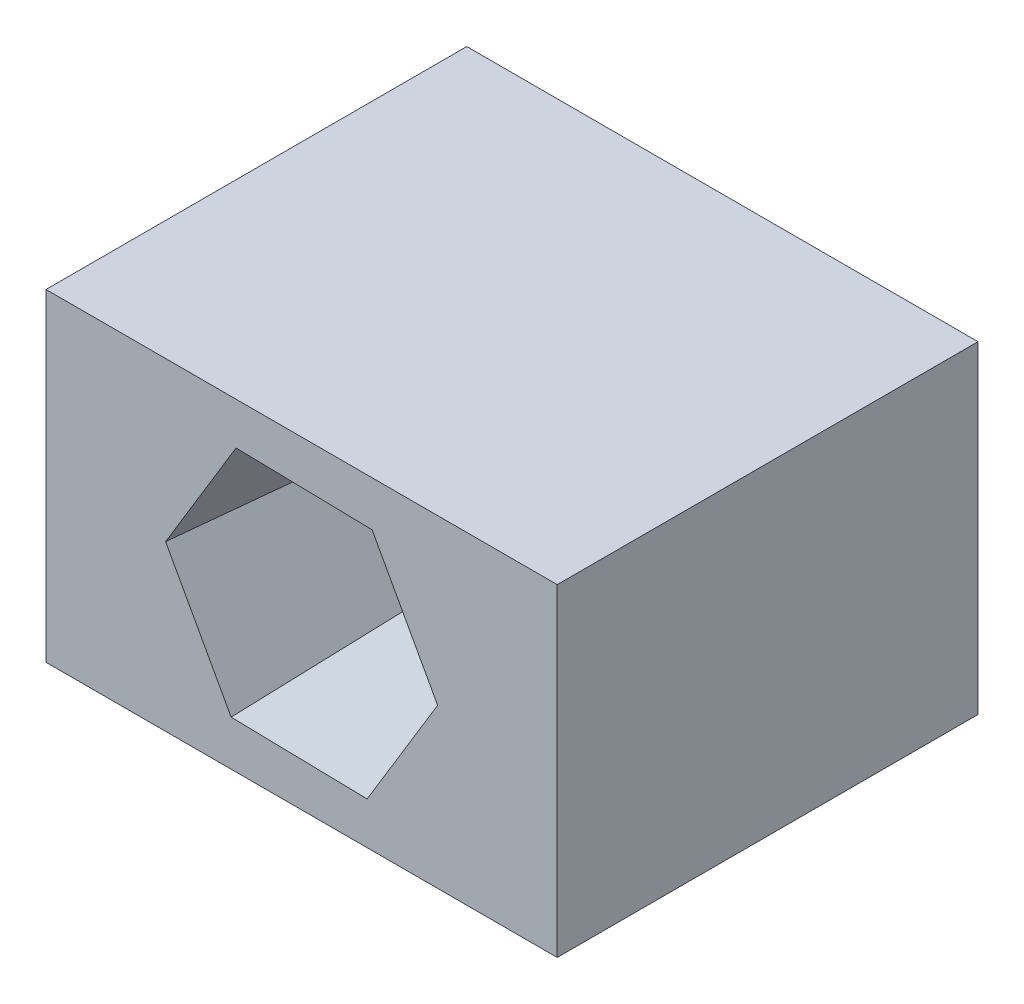
ISO-10303-21;
HEADER;
FILE_DESCRIPTION(('STEP AP214'),'2;1');
FILE_NAME('part.step','',(''),(''),'','','');
FILE_SCHEMA(('AUTOMOTIVE_DESIGN { 1 0 10303 214 1 1 1 1 }'));
ENDSEC;
DATA;
#1=APPLICATION_CONTEXT('core data for automotive mechanical design processes');
#2=APPLICATION_PROTOCOL_DEFINITION('international standard','automotive_design',2000,#1);
#3=PRODUCT_CONTEXT('',#1,'mechanical');
#4=PRODUCT('Part','Part','',(#3));
#5=PRODUCT_RELATED_PRODUCT_CATEGORY('part','',(#4));
#6=PRODUCT_DEFINITION_FORMATION('','',#4);
#7=PRODUCT_DEFINITION_CONTEXT('part definition',#1,'design');
#8=PRODUCT_DEFINITION('design','',#6,#7);
#9=PRODUCT_DEFINITION_SHAPE('','',#8);
#10=(LENGTH_UNIT() NAMED_UNIT(*) SI_UNIT(.MILLI.,.METRE.));
#11=(NAMED_UNIT(*) PLANE_ANGLE_UNIT() SI_UNIT($,.RADIAN.));
#12=(NAMED_UNIT(*) SI_UNIT($,.STERADIAN.) SOLID_ANGLE_UNIT());
#13=UNCERTAINTY_MEASURE_WITH_UNIT(LENGTH_MEASURE(1.E-05),#10,'distance_accuracy_value','');
#14=(GEOMETRIC_REPRESENTATION_CONTEXT(3) GLOBAL_UNCERTAINTY_ASSIGNED_CONTEXT((#13)) GLOBAL_UNIT_ASSIGNED_CONTEXT((#10,
#11,#12)) REPRESENTATION_CONTEXT('',''));
#15=CARTESIAN_POINT('',(0.,0.,0.));
#16=DIRECTION('',(0.,0.,1.));
#17=DIRECTION('',(1.,0.,0.));
#18=AXIS2_PLACEMENT_3D('',#15,#16,#17);
#19=CARTESIAN_POINT('',(0.,0.,10.));
#20=DIRECTION('',(0.,0.,-1.));
#21=DIRECTION('',(-1.,0.,0.));
#22=AXIS2_PLACEMENT_3D('',#19,#20,#21);
#23=CYLINDRICAL_SURFACE('',#22,1.7);
#24=CARTESIAN_POINT('',(0.,0.,0.));
#25=DIRECTION('',(0.,0.,1.));
#26=DIRECTION('',(1.,0.,0.));
#27=AXIS2_PLACEMENT_3D('',#24,#25,#26);
#28=CIRCLE('',#27,1.7);
#29=CARTESIAN_POINT('',(1.7,0.,0.));
#30=VERTEX_POINT('',#29);
#31=EDGE_CURVE('E176',#30,#30,#28,.T.);
#32=ORIENTED_EDGE('',*,*,#31,.F.);
#33=EDGE_LOOP('',(#32));
#34=FACE_BOUND('',#33,.T.);
#35=CARTESIAN_POINT('',(0.,0.,5.));
#36=DIRECTION('',(0.,0.,1.));
#37=DIRECTION('',(1.,0.,0.));
#38=AXIS2_PLACEMENT_3D('',#35,#36,#37);
#39=CIRCLE('',#38,1.7);
#40=CARTESIAN_POINT('',(1.7,0.,5.));
#41=VERTEX_POINT('',#40);
#42=EDGE_CURVE('E37',#41,#41,#39,.T.);
#43=ORIENTED_EDGE('',*,*,#42,.T.);
#44=EDGE_LOOP('',(#43));
#45=FACE_BOUND('',#44,.T.);
#46=ADVANCED_FACE('F33',(#34,#45),#23,.F.);
#47=CARTESIAN_POINT('',(0.,0.,10.));
#48=DIRECTION('',(0.,0.,-1.));
#49=DIRECTION('',(-1.,0.,0.));
#50=AXIS2_PLACEMENT_3D('',#47,#48,#49);
#51=PLANE('',#50);
#52=DIRECTION('',(-0.999775709837172,0.0211785273232077,0.));
#53=VECTOR('',#52,1.);
#54=CARTESIAN_POINT('',(1.67551804707545,2.76513518788102,10.));
#55=LINE('',#54,#53);
#56=CARTESIAN_POINT('',(1.67551804707545,2.76513518788102,10.));
#57=VERTEX_POINT('',#56);
#58=CARTESIAN_POINT('',(-1.55691829406549,2.83360878720715,10.));
#59=VERTEX_POINT('',#58);
#60=EDGE_CURVE('E135',#57,#59,#55,.T.);
#61=ORIENTED_EDGE('',*,*,#60,.F.);
#62=DIRECTION('',(-0.481546712241945,0.876420426467214,0.));
#63=VECTOR('',#62,1.);
#64=CARTESIAN_POINT('',(3.23243634114095,-0.068473599326124,10.));
#65=LINE('',#64,#63);
#66=CARTESIAN_POINT('',(3.23243634114095,-0.068473599326124,10.));
#67=VERTEX_POINT('',#66);
#68=EDGE_CURVE('E49',#67,#57,#65,.T.);
#69=ORIENTED_EDGE('',*,*,#68,.F.);
#70=DIRECTION('',(0.518228997595226,0.855241899144007,0.));
#71=VECTOR('',#70,1.);
#72=CARTESIAN_POINT('',(1.55691829406549,-2.83360878720714,10.));
#73=LINE('',#72,#71);
#74=CARTESIAN_POINT('',(1.55691829406549,-2.83360878720714,10.));
#75=VERTEX_POINT('',#74);
#76=EDGE_CURVE('E150',#75,#67,#73,.T.);
#77=ORIENTED_EDGE('',*,*,#76,.F.);
#78=DIRECTION('',(0.999775709837171,-0.0211785273232075,0.));
#79=VECTOR('',#78,1.);
#80=CARTESIAN_POINT('',(-1.67551804707546,-2.76513518788102,10.));
#81=LINE('',#80,#79);
#82=CARTESIAN_POINT('',(-1.67551804707546,-2.76513518788102,10.));
#83=VERTEX_POINT('',#82);
#84=EDGE_CURVE('E144',#83,#75,#81,.T.);
#85=ORIENTED_EDGE('',*,*,#84,.F.);
#86=DIRECTION('',(0.481546712241945,-0.876420426467214,0.));
#87=VECTOR('',#86,1.);
#88=CARTESIAN_POINT('',(-3.23243634114095,0.0684735993261259,10.));
#89=LINE('',#88,#87);
#90=CARTESIAN_POINT('',(-3.23243634114095,0.0684735993261259,10.));
#91=VERTEX_POINT('',#90);
#92=EDGE_CURVE('E142',#91,#83,#89,.T.);
#93=ORIENTED_EDGE('',*,*,#92,.F.);
#94=DIRECTION('',(-0.518228997595227,-0.855241899144006,0.));
#95=VECTOR('',#94,1.);
#96=CARTESIAN_POINT('',(-1.55691829406549,2.83360878720715,10.));
#97=LINE('',#96,#95);
#98=EDGE_CURVE('E124',#59,#91,#97,.T.);
#99=ORIENTED_EDGE('',*,*,#98,.F.);
#100=EDGE_LOOP('',(#61,#69,#77,#85,#93,#99));
#101=FACE_BOUND('',#100,.T.);
#102=DIRECTION('',(0.,1.,0.));
#103=VECTOR('',#102,1.);
#104=CARTESIAN_POINT('',(6.07477523083627,-3.83689246536686,10.));
#105=LINE('',#104,#103);
#106=CARTESIAN_POINT('',(6.07477523083627,-3.83689246536686,10.));
#107=VERTEX_POINT('',#106);
#108=CARTESIAN_POINT('',(6.07477523083627,3.83689246536687,10.));
#109=VERTEX_POINT('',#108);
#110=EDGE_CURVE('E180',#107,#109,#105,.T.);
#111=ORIENTED_EDGE('',*,*,#110,.T.);
#112=DIRECTION('',(-1.,0.,0.));
#113=VECTOR('',#112,1.);
#114=CARTESIAN_POINT('',(-6.07477523083627,3.83689246536687,10.));
#115=LINE('',#114,#113);
#116=CARTESIAN_POINT('',(-6.07477523083627,3.83689246536687,10.));
#117=VERTEX_POINT('',#116);
#118=EDGE_CURVE('E86',#109,#117,#115,.T.);
#119=ORIENTED_EDGE('',*,*,#118,.T.);
#120=DIRECTION('',(0.,-1.,0.));
#121=VECTOR('',#120,1.);
#122=CARTESIAN_POINT('',(-6.07477523083627,-3.83689246536686,10.));
#123=LINE('',#122,#121);
#124=CARTESIAN_POINT('',(-6.07477523083627,-3.83689246536686,10.));
#125=VERTEX_POINT('',#124);
#126=EDGE_CURVE('E183',#117,#125,#123,.T.);
#127=ORIENTED_EDGE('',*,*,#126,.T.);
#128=DIRECTION('',(1.,0.,0.));
#129=VECTOR('',#128,1.);
#130=CARTESIAN_POINT('',(-6.07477523083627,-3.83689246536686,10.));
#131=LINE('',#130,#129);
#132=EDGE_CURVE('E58',#125,#107,#131,.T.);
#133=ORIENTED_EDGE('',*,*,#132,.T.);
#134=EDGE_LOOP('',(#111,#119,#127,#133));
#135=FACE_BOUND('',#134,.T.);
#136=ADVANCED_FACE('F139',(#101,#135),#51,.F.);
#137=CARTESIAN_POINT('',(0.,0.,0.));
#138=DIRECTION('',(0.,0.,-1.));
#139=DIRECTION('',(-1.,0.,0.));
#140=AXIS2_PLACEMENT_3D('',#137,#138,#139);
#141=PLANE('',#140);
#142=DIRECTION('',(0.,1.,0.));
#143=VECTOR('',#142,1.);
#144=CARTESIAN_POINT('',(6.07477523083627,-3.83689246536686,0.));
#145=LINE('',#144,#143);
#146=CARTESIAN_POINT('',(6.07477523083627,-3.83689246536686,0.));
#147=VERTEX_POINT('',#146);
#148=CARTESIAN_POINT('',(6.07477523083627,3.83689246536687,0.));
#149=VERTEX_POINT('',#148);
#150=EDGE_CURVE('E179',#147,#149,#145,.T.);
#151=ORIENTED_EDGE('',*,*,#150,.F.);
#152=DIRECTION('',(1.,0.,0.));
#153=VECTOR('',#152,1.);
#154=CARTESIAN_POINT('',(-6.07477523083627,-3.83689246536686,0.));
#155=LINE('',#154,#153);
#156=CARTESIAN_POINT('',(-6.07477523083627,-3.83689246536686,0.));
#157=VERTEX_POINT('',#156);
#158=EDGE_CURVE('E79',#157,#147,#155,.T.);
#159=ORIENTED_EDGE('',*,*,#158,.F.);
#160=DIRECTION('',(0.,-1.,0.));
#161=VECTOR('',#160,1.);
#162=CARTESIAN_POINT('',(-6.07477523083627,-3.83689246536686,0.));
#163=LINE('',#162,#161);
#164=CARTESIAN_POINT('',(-6.07477523083627,3.83689246536687,0.));
#165=VERTEX_POINT('',#164);
#166=EDGE_CURVE('E191',#165,#157,#163,.T.);
#167=ORIENTED_EDGE('',*,*,#166,.F.);
#168=DIRECTION('',(-1.,0.,0.));
#169=VECTOR('',#168,1.);
#170=CARTESIAN_POINT('',(-6.07477523083627,3.83689246536687,0.));
#171=LINE('',#170,#169);
#172=EDGE_CURVE('E189',#149,#165,#171,.T.);
#173=ORIENTED_EDGE('',*,*,#172,.F.);
#174=EDGE_LOOP('',(#151,#159,#167,#173));
#175=FACE_BOUND('',#174,.T.);
#176=ORIENTED_EDGE('',*,*,#31,.T.);
#177=EDGE_LOOP('',(#176));
#178=FACE_BOUND('',#177,.T.);
#179=ADVANCED_FACE('F205',(#175,#178),#141,.T.);
#180=CARTESIAN_POINT('',(6.07477523083627,-3.83689246536686,10.));
#181=DIRECTION('',(-1.,0.,0.));
#182=DIRECTION('',(0.,0.,1.));
#183=AXIS2_PLACEMENT_3D('',#180,#181,#182);
#184=PLANE('',#183);
#185=ORIENTED_EDGE('',*,*,#150,.T.);
#186=DIRECTION('',(0.,0.,-1.));
#187=VECTOR('',#186,1.);
#188=CARTESIAN_POINT('',(6.07477523083627,3.83689246536687,10.));
#189=LINE('',#188,#187);
#190=EDGE_CURVE('E11',#109,#149,#189,.T.);
#191=ORIENTED_EDGE('',*,*,#190,.F.);
#192=ORIENTED_EDGE('',*,*,#110,.F.);
#193=DIRECTION('',(0.,0.,-1.));
#194=VECTOR('',#193,1.);
#195=CARTESIAN_POINT('',(6.07477523083627,-3.83689246536686,10.));
#196=LINE('',#195,#194);
#197=EDGE_CURVE('E186',#107,#147,#196,.T.);
#198=ORIENTED_EDGE('',*,*,#197,.T.);
#199=EDGE_LOOP('',(#185,#191,#192,#198));
#200=FACE_BOUND('',#199,.T.);
#201=ADVANCED_FACE('F35',(#200),#184,.F.);
#202=CARTESIAN_POINT('',(-6.07477523083627,3.83689246536687,10.));
#203=DIRECTION('',(0.,-1.,0.));
#204=DIRECTION('',(0.,0.,-1.));
#205=AXIS2_PLACEMENT_3D('',#202,#203,#204);
#206=PLANE('',#205);
#207=ORIENTED_EDGE('',*,*,#172,.T.);
#208=DIRECTION('',(0.,0.,-1.));
#209=VECTOR('',#208,1.);
#210=CARTESIAN_POINT('',(-6.07477523083627,3.83689246536687,10.));
#211=LINE('',#210,#209);
#212=EDGE_CURVE('E42',#117,#165,#211,.T.);
#213=ORIENTED_EDGE('',*,*,#212,.F.);
#214=ORIENTED_EDGE('',*,*,#118,.F.);
#215=ORIENTED_EDGE('',*,*,#190,.T.);
#216=EDGE_LOOP('',(#207,#213,#214,#215));
#217=FACE_BOUND('',#216,.T.);
#218=ADVANCED_FACE('F220',(#217),#206,.F.);
#219=CARTESIAN_POINT('',(-6.07477523083627,-3.83689246536686,10.));
#220=DIRECTION('',(1.,0.,0.));
#221=DIRECTION('',(0.,0.,-1.));
#222=AXIS2_PLACEMENT_3D('',#219,#220,#221);
#223=PLANE('',#222);
#224=ORIENTED_EDGE('',*,*,#166,.T.);
#225=DIRECTION('',(0.,0.,-1.));
#226=VECTOR('',#225,1.);
#227=CARTESIAN_POINT('',(-6.07477523083627,-3.83689246536686,10.));
#228=LINE('',#227,#226);
#229=EDGE_CURVE('E195',#125,#157,#228,.T.);
#230=ORIENTED_EDGE('',*,*,#229,.F.);
#231=ORIENTED_EDGE('',*,*,#126,.F.);
#232=ORIENTED_EDGE('',*,*,#212,.T.);
#233=EDGE_LOOP('',(#224,#230,#231,#232));
#234=FACE_BOUND('',#233,.T.);
#235=ADVANCED_FACE('F201',(#234),#223,.F.);
#236=CARTESIAN_POINT('',(-6.07477523083627,-3.83689246536686,10.));
#237=DIRECTION('',(0.,1.,0.));
#238=DIRECTION('',(0.,0.,1.));
#239=AXIS2_PLACEMENT_3D('',#236,#237,#238);
#240=PLANE('',#239);
#241=ORIENTED_EDGE('',*,*,#158,.T.);
#242=ORIENTED_EDGE('',*,*,#197,.F.);
#243=ORIENTED_EDGE('',*,*,#132,.F.);
#244=ORIENTED_EDGE('',*,*,#229,.T.);
#245=EDGE_LOOP('',(#241,#242,#243,#244));
#246=FACE_BOUND('',#245,.T.);
#247=ADVANCED_FACE('F210',(#246),#240,.F.);
#248=CARTESIAN_POINT('',(3.23243634114095,-0.068473599326124,10.));
#249=DIRECTION('',(0.873085382145945,0.479714281618937,-0.0871557427476584));
#250=DIRECTION('',(-0.481546712241945,0.876420426467214,0.));
#251=AXIS2_PLACEMENT_3D('',#248,#249,#250);
#252=PLANE('',#251);
#253=ORIENTED_EDGE('',*,*,#68,.T.);
#254=DIRECTION('',(0.0520880328405445,0.0859617434299145,0.994935885120892));
#255=VECTOR('',#254,1.);
#256=CARTESIAN_POINT('',(1.66705451575061,2.75116768193806,9.83833770310138));
#257=LINE('',#256,#255);
#258=CARTESIAN_POINT('',(1.41375227091081,2.33313879135206,5.));
#259=VERTEX_POINT('',#258);
#260=EDGE_CURVE('E132',#259,#57,#257,.T.);
#261=ORIENTED_EDGE('',*,*,#260,.F.);
#262=DIRECTION('',(-0.481546712241945,0.876420426467214,0.));
#263=VECTOR('',#262,1.);
#264=CARTESIAN_POINT('',(2.07059293511602,1.13768140288069,5.));
#265=LINE('',#264,#263);
#266=CARTESIAN_POINT('',(2.72743359932121,-0.0577759855906732,5.));
#267=VERTEX_POINT('',#266);
#268=EDGE_CURVE('E153',#267,#259,#265,.T.);
#269=ORIENTED_EDGE('',*,*,#268,.F.);
#270=DIRECTION('',(0.100489069984178,-0.00212868795811238,0.994935885120892));
#271=VECTOR('',#270,1.);
#272=CARTESIAN_POINT('',(3.21610836050441,-0.068127719164562,9.83833770310138));
#273=LINE('',#272,#271);
#274=EDGE_CURVE('E154',#267,#67,#273,.T.);
#275=ORIENTED_EDGE('',*,*,#274,.T.);
#276=EDGE_LOOP('',(#253,#261,#269,#275));
#277=FACE_BOUND('',#276,.T.);
#278=ADVANCED_FACE('F212',(#277),#252,.F.);
#279=CARTESIAN_POINT('',(1.55691829406549,-2.83360878720714,10.));
#280=DIRECTION('',(0.851987445513175,-0.516256979801764,-0.0871557427476584));
#281=DIRECTION('',(0.518228997595226,0.855241899144007,0.));
#282=AXIS2_PLACEMENT_3D('',#279,#280,#281);
#283=PLANE('',#282);
#284=ORIENTED_EDGE('',*,*,#76,.T.);
#285=ORIENTED_EDGE('',*,*,#274,.F.);
#286=DIRECTION('',(0.518228997595226,0.855241899144007,0.));
#287=VECTOR('',#286,1.);
#288=CARTESIAN_POINT('',(2.02055746386581,-1.22434538126671,5.));
#289=LINE('',#288,#287);
#290=CARTESIAN_POINT('',(1.3136813284104,-2.39091477694274,5.));
#291=VERTEX_POINT('',#290);
#292=EDGE_CURVE('E157',#291,#267,#289,.T.);
#293=ORIENTED_EDGE('',*,*,#292,.F.);
#294=DIRECTION('',(0.0484010371436338,-0.0880904313880269,0.994935885120891));
#295=VECTOR('',#294,1.);
#296=CARTESIAN_POINT('',(1.5490538447538,-2.81929540110262,9.83833770310138));
#297=LINE('',#296,#295);
#298=EDGE_CURVE('E156',#291,#75,#297,.T.);
#299=ORIENTED_EDGE('',*,*,#298,.T.);
#300=EDGE_LOOP('',(#284,#285,#293,#299));
#301=FACE_BOUND('',#300,.T.);
#302=ADVANCED_FACE('F218',(#301),#283,.F.);
#303=CARTESIAN_POINT('',(-1.67551804707546,-2.76513518788102,10.));
#304=DIRECTION('',(-0.0210979366327704,-0.995971261420702,-0.0871557427476584));
#305=DIRECTION('',(0.,0.0871751467355648,-0.996193000272353));
#306=AXIS2_PLACEMENT_3D('',#303,#304,#305);
#307=PLANE('',#306);
#308=ORIENTED_EDGE('',*,*,#84,.T.);
#309=ORIENTED_EDGE('',*,*,#298,.F.);
#310=DIRECTION('',(0.999775709837171,-0.0211785273232075,0.));
#311=VECTOR('',#310,1.);
#312=CARTESIAN_POINT('',(-0.0500354712502075,-2.3620267841474,5.));
#313=LINE('',#312,#311);
#314=CARTESIAN_POINT('',(-1.41375227091082,-2.33313879135206,5.));
#315=VERTEX_POINT('',#314);
#316=EDGE_CURVE('E168',#315,#291,#313,.T.);
#317=ORIENTED_EDGE('',*,*,#316,.F.);
#318=DIRECTION('',(-0.0520880328405445,-0.0859617434299146,0.994935885120892));
#319=VECTOR('',#318,1.);
#320=CARTESIAN_POINT('',(-1.66705451575061,-2.75116768193806,9.83833770310138));
#321=LINE('',#320,#319);
#322=EDGE_CURVE('E160',#315,#83,#321,.T.);
#323=ORIENTED_EDGE('',*,*,#322,.T.);
#324=EDGE_LOOP('',(#308,#309,#317,#323));
#325=FACE_BOUND('',#324,.T.);
#326=ADVANCED_FACE('F277',(#325),#307,.F.);
#327=CARTESIAN_POINT('',(-3.23243634114095,0.0684735993261259,10.));
#328=DIRECTION('',(-0.873085382145945,-0.479714281618937,-0.0871557427476584));
#329=DIRECTION('',(0.481546712241945,-0.876420426467214,0.));
#330=AXIS2_PLACEMENT_3D('',#327,#328,#329);
#331=PLANE('',#330);
#332=ORIENTED_EDGE('',*,*,#92,.T.);
#333=ORIENTED_EDGE('',*,*,#322,.F.);
#334=DIRECTION('',(0.481546712241945,-0.876420426467214,0.));
#335=VECTOR('',#334,1.);
#336=CARTESIAN_POINT('',(-2.07059293511601,-1.13768140288069,5.));
#337=LINE('',#336,#335);
#338=CARTESIAN_POINT('',(-2.72743359932122,0.0577759855906756,5.));
#339=VERTEX_POINT('',#338);
#340=EDGE_CURVE('E171',#339,#315,#337,.T.);
#341=ORIENTED_EDGE('',*,*,#340,.F.);
#342=DIRECTION('',(-0.100489069984178,0.00212868795811236,0.994935885120891));
#343=VECTOR('',#342,1.);
#344=CARTESIAN_POINT('',(-3.21610836050441,0.0681277191645646,9.83833770310138));
#345=LINE('',#344,#343);
#346=EDGE_CURVE('E131',#339,#91,#345,.T.);
#347=ORIENTED_EDGE('',*,*,#346,.T.);
#348=EDGE_LOOP('',(#332,#333,#341,#347));
#349=FACE_BOUND('',#348,.T.);
#350=ADVANCED_FACE('F286',(#349),#331,.F.);
#351=CARTESIAN_POINT('',(-1.55691829406549,2.83360878720715,10.));
#352=DIRECTION('',(-0.851987445513175,0.516256979801765,-0.0871557427476584));
#353=DIRECTION('',(-0.518228997595227,-0.855241899144006,0.));
#354=AXIS2_PLACEMENT_3D('',#351,#352,#353);
#355=PLANE('',#354);
#356=ORIENTED_EDGE('',*,*,#98,.T.);
#357=ORIENTED_EDGE('',*,*,#346,.F.);
#358=DIRECTION('',(-0.518228997595227,-0.855241899144006,0.));
#359=VECTOR('',#358,1.);
#360=CARTESIAN_POINT('',(-2.02055746386581,1.22434538126671,5.));
#361=LINE('',#360,#359);
#362=CARTESIAN_POINT('',(-1.3136813284104,2.39091477694274,5.));
#363=VERTEX_POINT('',#362);
#364=EDGE_CURVE('E127',#363,#339,#361,.T.);
#365=ORIENTED_EDGE('',*,*,#364,.F.);
#366=DIRECTION('',(-0.0484010371436338,0.088090431388027,0.994935885120892));
#367=VECTOR('',#366,1.);
#368=CARTESIAN_POINT('',(-1.5490538447538,2.81929540110263,9.83833770310138));
#369=LINE('',#368,#367);
#370=EDGE_CURVE('E120',#363,#59,#369,.T.);
#371=ORIENTED_EDGE('',*,*,#370,.T.);
#372=EDGE_LOOP('',(#356,#357,#365,#371));
#373=FACE_BOUND('',#372,.T.);
#374=ADVANCED_FACE('F122',(#373),#355,.F.);
#375=CARTESIAN_POINT('',(1.67551804707545,2.76513518788102,10.));
#376=DIRECTION('',(0.0210979366327707,0.995971261420702,-0.0871557427476584));
#377=DIRECTION('',(0.,0.0871751467355647,0.996193000272353));
#378=AXIS2_PLACEMENT_3D('',#375,#376,#377);
#379=PLANE('',#378);
#380=ORIENTED_EDGE('',*,*,#60,.T.);
#381=ORIENTED_EDGE('',*,*,#370,.F.);
#382=DIRECTION('',(-0.999775709837172,0.0211785273232077,0.));
#383=VECTOR('',#382,1.);
#384=CARTESIAN_POINT('',(0.0500354712502082,2.3620267841474,5.));
#385=LINE('',#384,#383);
#386=EDGE_CURVE('E165',#259,#363,#385,.T.);
#387=ORIENTED_EDGE('',*,*,#386,.F.);
#388=ORIENTED_EDGE('',*,*,#260,.T.);
#389=EDGE_LOOP('',(#380,#381,#387,#388));
#390=FACE_BOUND('',#389,.T.);
#391=ADVANCED_FACE('F136',(#390),#379,.F.);
#392=CARTESIAN_POINT('',(0.,0.,5.));
#393=DIRECTION('',(0.,0.,1.));
#394=DIRECTION('',(1.,0.,0.));
#395=AXIS2_PLACEMENT_3D('',#392,#393,#394);
#396=PLANE('',#395);
#397=ORIENTED_EDGE('',*,*,#42,.F.);
#398=EDGE_LOOP('',(#397));
#399=FACE_BOUND('',#398,.T.);
#400=ORIENTED_EDGE('',*,*,#268,.T.);
#401=ORIENTED_EDGE('',*,*,#386,.T.);
#402=ORIENTED_EDGE('',*,*,#364,.T.);
#403=ORIENTED_EDGE('',*,*,#340,.T.);
#404=ORIENTED_EDGE('',*,*,#316,.T.);
#405=ORIENTED_EDGE('',*,*,#292,.T.);
#406=EDGE_LOOP('',(#400,#401,#402,#403,#404,#405));
#407=FACE_BOUND('',#406,.T.);
#408=ADVANCED_FACE('F312',(#399,#407),#396,.T.);
#409=CLOSED_SHELL('',(#46,#136,#179,#201,#218,#235,#247,#278,#302,#326,#350,#374,#391,#408));
#410=MANIFOLD_SOLID_BREP('B2',#409);
#411=ADVANCED_BREP_SHAPE_REPRESENTATION('',(#18,#410),#14);
#412=SHAPE_DEFINITION_REPRESENTATION(#9,#411);
ENDSEC;
END-ISO-10303-21;
